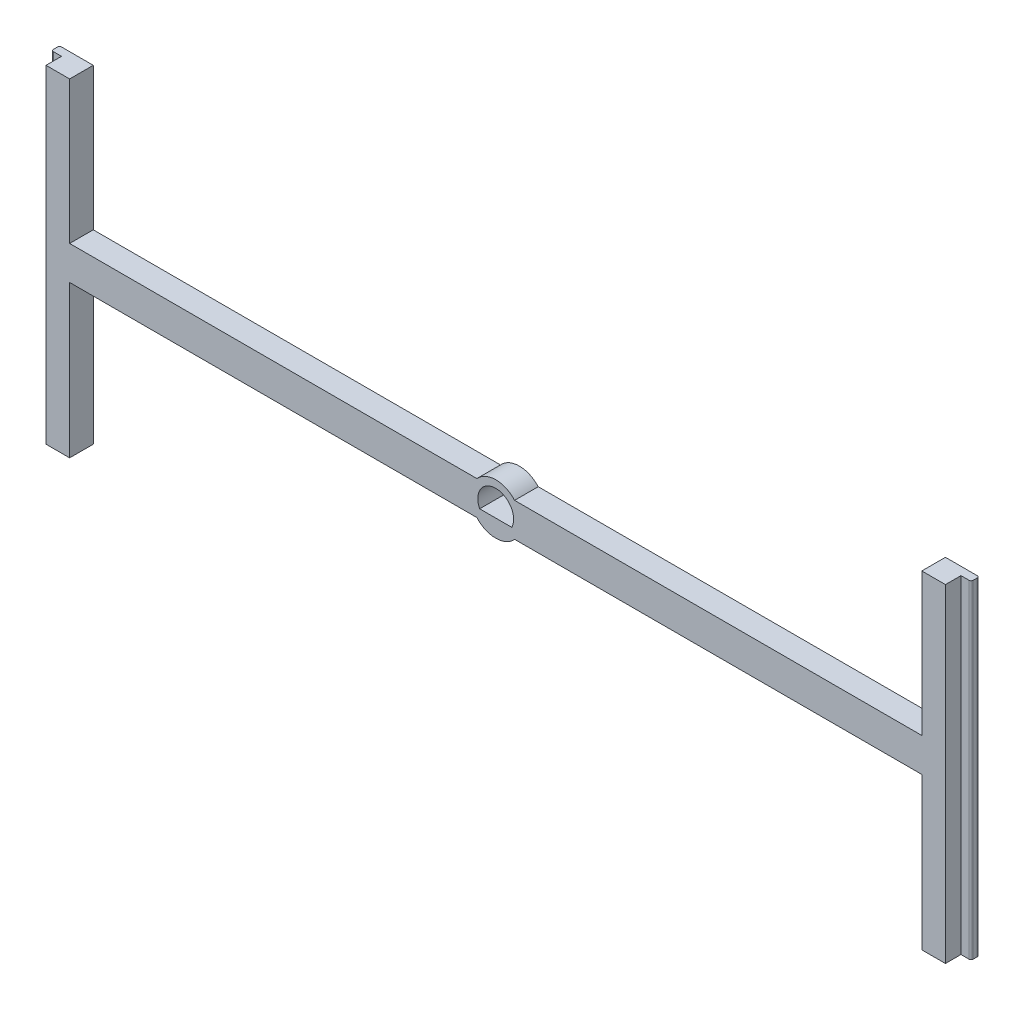
ISO-10303-21;
HEADER;
FILE_DESCRIPTION(('STEP AP214'),'2;1');
FILE_NAME('part.step','',(''),(''),'','','');
FILE_SCHEMA(('AUTOMOTIVE_DESIGN { 1 0 10303 214 1 1 1 1 }'));
ENDSEC;
DATA;
#1=APPLICATION_CONTEXT('core data for automotive mechanical design processes');
#2=APPLICATION_PROTOCOL_DEFINITION('international standard','automotive_design',2000,#1);
#3=PRODUCT_CONTEXT('',#1,'mechanical');
#4=PRODUCT('Part','Part','',(#3));
#5=PRODUCT_RELATED_PRODUCT_CATEGORY('part','',(#4));
#6=PRODUCT_DEFINITION_FORMATION('','',#4);
#7=PRODUCT_DEFINITION_CONTEXT('part definition',#1,'design');
#8=PRODUCT_DEFINITION('design','',#6,#7);
#9=PRODUCT_DEFINITION_SHAPE('','',#8);
#10=(LENGTH_UNIT() NAMED_UNIT(*) SI_UNIT(.MILLI.,.METRE.));
#11=(NAMED_UNIT(*) PLANE_ANGLE_UNIT() SI_UNIT($,.RADIAN.));
#12=(NAMED_UNIT(*) SI_UNIT($,.STERADIAN.) SOLID_ANGLE_UNIT());
#13=UNCERTAINTY_MEASURE_WITH_UNIT(LENGTH_MEASURE(1.E-05),#10,'distance_accuracy_value','');
#14=(GEOMETRIC_REPRESENTATION_CONTEXT(3) GLOBAL_UNCERTAINTY_ASSIGNED_CONTEXT((#13)) GLOBAL_UNIT_ASSIGNED_CONTEXT((#10,
#11,#12)) REPRESENTATION_CONTEXT('',''));
#15=CARTESIAN_POINT('',(0.,0.,0.));
#16=DIRECTION('',(0.,0.,1.));
#17=DIRECTION('',(1.,0.,0.));
#18=AXIS2_PLACEMENT_3D('',#15,#16,#17);
#19=CARTESIAN_POINT('',(0.,0.,3.5));
#20=DIRECTION('',(0.,0.,1.));
#21=DIRECTION('',(1.,0.,0.));
#22=AXIS2_PLACEMENT_3D('',#19,#20,#21);
#23=PLANE('',#22);
#24=DIRECTION('',(1.,0.,0.));
#25=VECTOR('',#24,1.);
#26=CARTESIAN_POINT('',(-68.1,23.6,3.5));
#27=LINE('',#26,#25);
#28=CARTESIAN_POINT('',(-66.6,23.6,3.5));
#29=VERTEX_POINT('',#28);
#30=CARTESIAN_POINT('',(-63.1,23.6,3.5));
#31=VERTEX_POINT('',#30);
#32=EDGE_CURVE('E212',#29,#31,#27,.T.);
#33=ORIENTED_EDGE('',*,*,#32,.F.);
#34=DIRECTION('',(0.,-1.,0.));
#35=VECTOR('',#34,1.);
#36=CARTESIAN_POINT('',(-66.6,25.,3.49999999999998));
#37=LINE('',#36,#35);
#38=CARTESIAN_POINT('',(-66.6,-25.,3.49999999999998));
#39=VERTEX_POINT('',#38);
#40=EDGE_CURVE('E225',#29,#39,#37,.T.);
#41=ORIENTED_EDGE('',*,*,#40,.T.);
#42=DIRECTION('',(1.,0.,0.));
#43=VECTOR('',#42,1.);
#44=CARTESIAN_POINT('',(-63.1,-25.,3.5));
#45=LINE('',#44,#43);
#46=CARTESIAN_POINT('',(-63.1,-25.,3.5));
#47=VERTEX_POINT('',#46);
#48=EDGE_CURVE('E263',#39,#47,#45,.T.);
#49=ORIENTED_EDGE('',*,*,#48,.T.);
#50=DIRECTION('',(0.,1.,0.));
#51=VECTOR('',#50,1.);
#52=CARTESIAN_POINT('',(-63.1,-2.50000000000002,3.5));
#53=LINE('',#52,#51);
#54=CARTESIAN_POINT('',(-63.1,-2.50000000000002,3.5));
#55=VERTEX_POINT('',#54);
#56=EDGE_CURVE('E266',#47,#55,#53,.T.);
#57=ORIENTED_EDGE('',*,*,#56,.T.);
#58=DIRECTION('',(1.,0.,0.));
#59=VECTOR('',#58,1.);
#60=CARTESIAN_POINT('',(-63.1,-2.50000000000002,3.5));
#61=LINE('',#60,#59);
#62=CARTESIAN_POINT('',(-2.79508497187472,-2.50000000000002,3.5));
#63=VERTEX_POINT('',#62);
#64=EDGE_CURVE('E268',#55,#63,#61,.T.);
#65=ORIENTED_EDGE('',*,*,#64,.T.);
#66=CARTESIAN_POINT('',(0.,0.,3.5));
#67=DIRECTION('',(0.,0.,1.));
#68=DIRECTION('',(1.,0.,0.));
#69=AXIS2_PLACEMENT_3D('',#66,#67,#68);
#70=CIRCLE('',#69,3.75);
#71=CARTESIAN_POINT('',(2.79508497187472,-2.50000000000002,3.5));
#72=VERTEX_POINT('',#71);
#73=EDGE_CURVE('E270',#63,#72,#70,.T.);
#74=ORIENTED_EDGE('',*,*,#73,.T.);
#75=DIRECTION('',(1.,0.,0.));
#76=VECTOR('',#75,1.);
#77=CARTESIAN_POINT('',(2.79508497187472,-2.50000000000002,3.5));
#78=LINE('',#77,#76);
#79=CARTESIAN_POINT('',(63.1,-2.5,3.5));
#80=VERTEX_POINT('',#79);
#81=EDGE_CURVE('E272',#72,#80,#78,.T.);
#82=ORIENTED_EDGE('',*,*,#81,.T.);
#83=DIRECTION('',(0.,-1.,0.));
#84=VECTOR('',#83,1.);
#85=CARTESIAN_POINT('',(63.1,-2.5,3.5));
#86=LINE('',#85,#84);
#87=CARTESIAN_POINT('',(63.1,-25.,3.5));
#88=VERTEX_POINT('',#87);
#89=EDGE_CURVE('E274',#80,#88,#86,.T.);
#90=ORIENTED_EDGE('',*,*,#89,.T.);
#91=DIRECTION('',(1.,0.,0.));
#92=VECTOR('',#91,1.);
#93=CARTESIAN_POINT('',(63.1,-25.,3.5));
#94=LINE('',#93,#92);
#95=CARTESIAN_POINT('',(66.6,-25.,3.5));
#96=VERTEX_POINT('',#95);
#97=EDGE_CURVE('E276',#88,#96,#94,.T.);
#98=ORIENTED_EDGE('',*,*,#97,.T.);
#99=DIRECTION('',(0.,-1.,0.));
#100=VECTOR('',#99,1.);
#101=CARTESIAN_POINT('',(66.6,25.,3.5));
#102=LINE('',#101,#100);
#103=CARTESIAN_POINT('',(66.6,23.6,3.5));
#104=VERTEX_POINT('',#103);
#105=EDGE_CURVE('E253',#104,#96,#102,.T.);
#106=ORIENTED_EDGE('',*,*,#105,.F.);
#107=CARTESIAN_POINT('',(63.1,23.6,3.5));
#108=VERTEX_POINT('',#107);
#109=EDGE_CURVE('E230',#108,#104,#27,.T.);
#110=ORIENTED_EDGE('',*,*,#109,.F.);
#111=DIRECTION('',(0.,-1.,0.));
#112=VECTOR('',#111,1.);
#113=CARTESIAN_POINT('',(63.1,25.,3.5));
#114=LINE('',#113,#112);
#115=CARTESIAN_POINT('',(63.1,2.5,3.5));
#116=VERTEX_POINT('',#115);
#117=EDGE_CURVE('E279',#108,#116,#114,.T.);
#118=ORIENTED_EDGE('',*,*,#117,.T.);
#119=DIRECTION('',(-1.,0.,0.));
#120=VECTOR('',#119,1.);
#121=CARTESIAN_POINT('',(2.79508497187472,2.50000000000002,3.5));
#122=LINE('',#121,#120);
#123=CARTESIAN_POINT('',(2.79508497187472,2.50000000000002,3.5));
#124=VERTEX_POINT('',#123);
#125=EDGE_CURVE('E281',#116,#124,#122,.T.);
#126=ORIENTED_EDGE('',*,*,#125,.T.);
#127=CARTESIAN_POINT('',(0.,0.,3.5));
#128=DIRECTION('',(0.,0.,1.));
#129=DIRECTION('',(1.,0.,0.));
#130=AXIS2_PLACEMENT_3D('',#127,#128,#129);
#131=CIRCLE('',#130,3.75);
#132=CARTESIAN_POINT('',(-2.79508497187472,2.50000000000002,3.5));
#133=VERTEX_POINT('',#132);
#134=EDGE_CURVE('E283',#124,#133,#131,.T.);
#135=ORIENTED_EDGE('',*,*,#134,.T.);
#136=DIRECTION('',(-1.,0.,0.));
#137=VECTOR('',#136,1.);
#138=CARTESIAN_POINT('',(-63.1,2.50000000000002,3.5));
#139=LINE('',#138,#137);
#140=CARTESIAN_POINT('',(-63.1,2.50000000000002,3.5));
#141=VERTEX_POINT('',#140);
#142=EDGE_CURVE('E285',#133,#141,#139,.T.);
#143=ORIENTED_EDGE('',*,*,#142,.T.);
#144=DIRECTION('',(0.,1.,0.));
#145=VECTOR('',#144,1.);
#146=CARTESIAN_POINT('',(-63.1,25.,3.5));
#147=LINE('',#146,#145);
#148=EDGE_CURVE('E228',#141,#31,#147,.T.);
#149=ORIENTED_EDGE('',*,*,#148,.T.);
#150=EDGE_LOOP('',(#33,#41,#49,#57,#65,#74,#82,#90,#98,#106,#110,#118,#126,#135,#143,#149));
#151=FACE_BOUND('',#150,.T.);
#152=DIRECTION('',(1.,0.,0.));
#153=VECTOR('',#152,1.);
#154=CARTESIAN_POINT('',(-2.3777300099044,-1.17,3.5));
#155=LINE('',#154,#153);
#156=CARTESIAN_POINT('',(-2.3777300099044,-1.17,3.5));
#157=VERTEX_POINT('',#156);
#158=CARTESIAN_POINT('',(2.37773000990441,-1.17,3.5));
#159=VERTEX_POINT('',#158);
#160=EDGE_CURVE('E246',#157,#159,#155,.T.);
#161=ORIENTED_EDGE('',*,*,#160,.F.);
#162=CARTESIAN_POINT('',(0.,0.,3.5));
#163=DIRECTION('',(0.,0.,1.));
#164=DIRECTION('',(1.,0.,0.));
#165=AXIS2_PLACEMENT_3D('',#162,#163,#164);
#166=CIRCLE('',#165,2.65);
#167=EDGE_CURVE('E243',#159,#157,#166,.T.);
#168=ORIENTED_EDGE('',*,*,#167,.F.);
#169=EDGE_LOOP('',(#161,#168));
#170=FACE_BOUND('',#169,.T.);
#171=ADVANCED_FACE('F35',(#151,#170),#23,.T.);
#172=CARTESIAN_POINT('',(0.,0.,0.));
#173=DIRECTION('',(0.,0.,1.));
#174=DIRECTION('',(1.,0.,0.));
#175=AXIS2_PLACEMENT_3D('',#172,#173,#174);
#176=PLANE('',#175);
#177=DIRECTION('',(1.,0.,0.));
#178=VECTOR('',#177,1.);
#179=CARTESIAN_POINT('',(-68.1,23.6,0.));
#180=LINE('',#179,#178);
#181=CARTESIAN_POINT('',(63.1,23.6,0.));
#182=VERTEX_POINT('',#181);
#183=CARTESIAN_POINT('',(67.8,23.6,0.));
#184=VERTEX_POINT('',#183);
#185=EDGE_CURVE('E229',#182,#184,#180,.T.);
#186=ORIENTED_EDGE('',*,*,#185,.T.);
#187=DIRECTION('',(0.,1.,0.));
#188=VECTOR('',#187,1.);
#189=CARTESIAN_POINT('',(67.8,0.,0.));
#190=LINE('',#189,#188);
#191=CARTESIAN_POINT('',(67.8,-25.,0.));
#192=VERTEX_POINT('',#191);
#193=EDGE_CURVE('E360',#184,#192,#190,.F.);
#194=ORIENTED_EDGE('',*,*,#193,.T.);
#195=DIRECTION('',(1.,0.,0.));
#196=VECTOR('',#195,1.);
#197=CARTESIAN_POINT('',(63.1,-25.,0.));
#198=LINE('',#197,#196);
#199=CARTESIAN_POINT('',(63.1,-25.,0.));
#200=VERTEX_POINT('',#199);
#201=EDGE_CURVE('E302',#200,#192,#198,.T.);
#202=ORIENTED_EDGE('',*,*,#201,.F.);
#203=DIRECTION('',(0.,-1.,0.));
#204=VECTOR('',#203,1.);
#205=CARTESIAN_POINT('',(63.1,-2.5,0.));
#206=LINE('',#205,#204);
#207=CARTESIAN_POINT('',(63.1,-2.5,0.));
#208=VERTEX_POINT('',#207);
#209=EDGE_CURVE('E300',#208,#200,#206,.T.);
#210=ORIENTED_EDGE('',*,*,#209,.F.);
#211=DIRECTION('',(1.,0.,0.));
#212=VECTOR('',#211,1.);
#213=CARTESIAN_POINT('',(2.79508497187472,-2.50000000000002,0.));
#214=LINE('',#213,#212);
#215=CARTESIAN_POINT('',(2.79508497187472,-2.50000000000002,0.));
#216=VERTEX_POINT('',#215);
#217=EDGE_CURVE('E298',#216,#208,#214,.T.);
#218=ORIENTED_EDGE('',*,*,#217,.F.);
#219=CARTESIAN_POINT('',(0.,0.,0.));
#220=DIRECTION('',(0.,0.,1.));
#221=DIRECTION('',(1.,0.,0.));
#222=AXIS2_PLACEMENT_3D('',#219,#220,#221);
#223=CIRCLE('',#222,3.75);
#224=CARTESIAN_POINT('',(-2.79508497187472,-2.50000000000002,0.));
#225=VERTEX_POINT('',#224);
#226=EDGE_CURVE('E296',#225,#216,#223,.T.);
#227=ORIENTED_EDGE('',*,*,#226,.F.);
#228=DIRECTION('',(1.,0.,0.));
#229=VECTOR('',#228,1.);
#230=CARTESIAN_POINT('',(-63.1,-2.50000000000002,0.));
#231=LINE('',#230,#229);
#232=CARTESIAN_POINT('',(-63.1,-2.50000000000002,0.));
#233=VERTEX_POINT('',#232);
#234=EDGE_CURVE('E294',#233,#225,#231,.T.);
#235=ORIENTED_EDGE('',*,*,#234,.F.);
#236=DIRECTION('',(0.,1.,0.));
#237=VECTOR('',#236,1.);
#238=CARTESIAN_POINT('',(-63.1,-2.50000000000002,0.));
#239=LINE('',#238,#237);
#240=CARTESIAN_POINT('',(-63.1,-25.,0.));
#241=VERTEX_POINT('',#240);
#242=EDGE_CURVE('E292',#241,#233,#239,.T.);
#243=ORIENTED_EDGE('',*,*,#242,.F.);
#244=DIRECTION('',(1.,0.,0.));
#245=VECTOR('',#244,1.);
#246=CARTESIAN_POINT('',(-63.1,-25.,0.));
#247=LINE('',#246,#245);
#248=CARTESIAN_POINT('',(-67.8,-25.,0.));
#249=VERTEX_POINT('',#248);
#250=EDGE_CURVE('E290',#249,#241,#247,.T.);
#251=ORIENTED_EDGE('',*,*,#250,.F.);
#252=DIRECTION('',(0.,-1.,0.));
#253=VECTOR('',#252,1.);
#254=CARTESIAN_POINT('',(-67.8,0.,0.));
#255=LINE('',#254,#253);
#256=CARTESIAN_POINT('',(-67.8,23.6,0.));
#257=VERTEX_POINT('',#256);
#258=EDGE_CURVE('E358',#249,#257,#255,.F.);
#259=ORIENTED_EDGE('',*,*,#258,.T.);
#260=CARTESIAN_POINT('',(-63.1,23.6,0.));
#261=VERTEX_POINT('',#260);
#262=EDGE_CURVE('E379',#257,#261,#180,.T.);
#263=ORIENTED_EDGE('',*,*,#262,.T.);
#264=DIRECTION('',(0.,1.,0.));
#265=VECTOR('',#264,1.);
#266=CARTESIAN_POINT('',(-63.1,25.,0.));
#267=LINE('',#266,#265);
#268=CARTESIAN_POINT('',(-63.1,2.50000000000002,0.));
#269=VERTEX_POINT('',#268);
#270=EDGE_CURVE('E261',#269,#261,#267,.T.);
#271=ORIENTED_EDGE('',*,*,#270,.F.);
#272=DIRECTION('',(-1.,0.,0.));
#273=VECTOR('',#272,1.);
#274=CARTESIAN_POINT('',(-63.1,2.50000000000002,0.));
#275=LINE('',#274,#273);
#276=CARTESIAN_POINT('',(-2.79508497187472,2.50000000000002,0.));
#277=VERTEX_POINT('',#276);
#278=EDGE_CURVE('E264',#277,#269,#275,.T.);
#279=ORIENTED_EDGE('',*,*,#278,.F.);
#280=CARTESIAN_POINT('',(0.,0.,0.));
#281=DIRECTION('',(0.,0.,1.));
#282=DIRECTION('',(1.,0.,0.));
#283=AXIS2_PLACEMENT_3D('',#280,#281,#282);
#284=CIRCLE('',#283,3.75);
#285=CARTESIAN_POINT('',(2.79508497187472,2.50000000000002,0.));
#286=VERTEX_POINT('',#285);
#287=EDGE_CURVE('E309',#286,#277,#284,.T.);
#288=ORIENTED_EDGE('',*,*,#287,.F.);
#289=DIRECTION('',(-1.,0.,0.));
#290=VECTOR('',#289,1.);
#291=CARTESIAN_POINT('',(2.79508497187472,2.50000000000002,0.));
#292=LINE('',#291,#290);
#293=CARTESIAN_POINT('',(63.1,2.5,0.));
#294=VERTEX_POINT('',#293);
#295=EDGE_CURVE('E307',#294,#286,#292,.T.);
#296=ORIENTED_EDGE('',*,*,#295,.F.);
#297=DIRECTION('',(0.,-1.,0.));
#298=VECTOR('',#297,1.);
#299=CARTESIAN_POINT('',(63.1,25.,0.));
#300=LINE('',#299,#298);
#301=EDGE_CURVE('E305',#182,#294,#300,.T.);
#302=ORIENTED_EDGE('',*,*,#301,.F.);
#303=EDGE_LOOP('',(#186,#194,#202,#210,#218,#227,#235,#243,#251,#259,#263,#271,#279,#288,#296,#302));
#304=FACE_BOUND('',#303,.T.);
#305=CARTESIAN_POINT('',(0.,0.,0.));
#306=DIRECTION('',(0.,0.,1.));
#307=DIRECTION('',(1.,0.,0.));
#308=AXIS2_PLACEMENT_3D('',#305,#306,#307);
#309=CIRCLE('',#308,2.65);
#310=CARTESIAN_POINT('',(2.37773000990441,-1.17,0.));
#311=VERTEX_POINT('',#310);
#312=CARTESIAN_POINT('',(-2.3777300099044,-1.17,0.));
#313=VERTEX_POINT('',#312);
#314=EDGE_CURVE('E250',#311,#313,#309,.T.);
#315=ORIENTED_EDGE('',*,*,#314,.T.);
#316=DIRECTION('',(1.,0.,0.));
#317=VECTOR('',#316,1.);
#318=CARTESIAN_POINT('',(-2.3777300099044,-1.17,0.));
#319=LINE('',#318,#317);
#320=EDGE_CURVE('E247',#313,#311,#319,.T.);
#321=ORIENTED_EDGE('',*,*,#320,.T.);
#322=EDGE_LOOP('',(#315,#321));
#323=FACE_BOUND('',#322,.T.);
#324=ADVANCED_FACE('F395',(#304,#323),#176,.F.);
#325=CARTESIAN_POINT('',(-63.1,25.,3.5));
#326=DIRECTION('',(-1.,0.,0.));
#327=DIRECTION('',(0.,-1.,0.));
#328=AXIS2_PLACEMENT_3D('',#325,#326,#327);
#329=PLANE('',#328);
#330=ORIENTED_EDGE('',*,*,#270,.T.);
#331=DIRECTION('',(0.,0.,1.));
#332=VECTOR('',#331,1.);
#333=CARTESIAN_POINT('',(-63.1,23.6,3.5));
#334=LINE('',#333,#332);
#335=EDGE_CURVE('E410',#261,#31,#334,.T.);
#336=ORIENTED_EDGE('',*,*,#335,.T.);
#337=ORIENTED_EDGE('',*,*,#148,.F.);
#338=DIRECTION('',(0.,0.,-1.));
#339=VECTOR('',#338,1.);
#340=CARTESIAN_POINT('',(-63.1,2.50000000000002,3.5));
#341=LINE('',#340,#339);
#342=EDGE_CURVE('E287',#141,#269,#341,.T.);
#343=ORIENTED_EDGE('',*,*,#342,.T.);
#344=EDGE_LOOP('',(#330,#336,#337,#343));
#345=FACE_BOUND('',#344,.T.);
#346=ADVANCED_FACE('F490',(#345),#329,.F.);
#347=CARTESIAN_POINT('',(-68.1,25.,3.5));
#348=DIRECTION('',(1.,0.,0.));
#349=DIRECTION('',(0.,0.,-1.));
#350=AXIS2_PLACEMENT_3D('',#347,#348,#349);
#351=PLANE('',#350);
#352=DIRECTION('',(0.,0.,1.));
#353=VECTOR('',#352,1.);
#354=CARTESIAN_POINT('',(-68.1,23.6,0.));
#355=LINE('',#354,#353);
#356=CARTESIAN_POINT('',(-68.1,23.6,0.3));
#357=VERTEX_POINT('',#356);
#358=CARTESIAN_POINT('',(-68.1,23.6,0.899999999999984));
#359=VERTEX_POINT('',#358);
#360=EDGE_CURVE('E378',#357,#359,#355,.T.);
#361=ORIENTED_EDGE('',*,*,#360,.F.);
#362=DIRECTION('',(0.,-1.,0.));
#363=VECTOR('',#362,1.);
#364=CARTESIAN_POINT('',(-68.1,25.,0.3));
#365=LINE('',#364,#363);
#366=CARTESIAN_POINT('',(-68.1,-25.,0.3));
#367=VERTEX_POINT('',#366);
#368=EDGE_CURVE('E370',#357,#367,#365,.T.);
#369=ORIENTED_EDGE('',*,*,#368,.T.);
#370=DIRECTION('',(0.,0.,-1.));
#371=VECTOR('',#370,1.);
#372=CARTESIAN_POINT('',(-68.1,-25.,3.5));
#373=LINE('',#372,#371);
#374=CARTESIAN_POINT('',(-68.1,-25.,0.899999999999984));
#375=VERTEX_POINT('',#374);
#376=EDGE_CURVE('E344',#375,#367,#373,.T.);
#377=ORIENTED_EDGE('',*,*,#376,.F.);
#378=DIRECTION('',(0.,-1.,0.));
#379=VECTOR('',#378,1.);
#380=CARTESIAN_POINT('',(-68.1,25.,0.899999999999984));
#381=LINE('',#380,#379);
#382=EDGE_CURVE('E368',#375,#359,#381,.F.);
#383=ORIENTED_EDGE('',*,*,#382,.T.);
#384=EDGE_LOOP('',(#361,#369,#377,#383));
#385=FACE_BOUND('',#384,.T.);
#386=ADVANCED_FACE('F384',(#385),#351,.F.);
#387=CARTESIAN_POINT('',(-63.1,-25.,3.5));
#388=DIRECTION('',(0.,1.,0.));
#389=DIRECTION('',(-1.,0.,0.));
#390=AXIS2_PLACEMENT_3D('',#387,#388,#389);
#391=PLANE('',#390);
#392=ORIENTED_EDGE('',*,*,#376,.T.);
#393=CARTESIAN_POINT('',(-67.8,-25.,0.3));
#394=DIRECTION('',(0.,1.,0.));
#395=DIRECTION('',(-1.,0.,0.));
#396=AXIS2_PLACEMENT_3D('',#393,#394,#395);
#397=CIRCLE('',#396,0.3);
#398=EDGE_CURVE('E374',#367,#249,#397,.F.);
#399=ORIENTED_EDGE('',*,*,#398,.T.);
#400=ORIENTED_EDGE('',*,*,#250,.T.);
#401=DIRECTION('',(0.,0.,-1.));
#402=VECTOR('',#401,1.);
#403=CARTESIAN_POINT('',(-63.1,-25.,3.5));
#404=LINE('',#403,#402);
#405=EDGE_CURVE('E341',#47,#241,#404,.T.);
#406=ORIENTED_EDGE('',*,*,#405,.F.);
#407=ORIENTED_EDGE('',*,*,#48,.F.);
#408=DIRECTION('',(0.,0.,1.));
#409=VECTOR('',#408,1.);
#410=CARTESIAN_POINT('',(-66.6,-25.,3.49999999999998));
#411=LINE('',#410,#409);
#412=CARTESIAN_POINT('',(-66.6,-25.,1.19999999999998));
#413=VERTEX_POINT('',#412);
#414=EDGE_CURVE('E234',#413,#39,#411,.T.);
#415=ORIENTED_EDGE('',*,*,#414,.F.);
#416=DIRECTION('',(1.,0.,0.));
#417=VECTOR('',#416,1.);
#418=CARTESIAN_POINT('',(-66.6,-25.,1.19999999999998));
#419=LINE('',#418,#417);
#420=CARTESIAN_POINT('',(-67.8,-25.,1.19999999999998));
#421=VERTEX_POINT('',#420);
#422=EDGE_CURVE('E237',#421,#413,#419,.T.);
#423=ORIENTED_EDGE('',*,*,#422,.F.);
#424=CARTESIAN_POINT('',(-67.8,-25.,0.899999999999984));
#425=DIRECTION('',(0.,1.,0.));
#426=DIRECTION('',(-1.,0.,0.));
#427=AXIS2_PLACEMENT_3D('',#424,#425,#426);
#428=CIRCLE('',#427,0.3);
#429=EDGE_CURVE('E58',#421,#375,#428,.F.);
#430=ORIENTED_EDGE('',*,*,#429,.T.);
#431=EDGE_LOOP('',(#392,#399,#400,#406,#407,#415,#423,#430));
#432=FACE_BOUND('',#431,.T.);
#433=ADVANCED_FACE('F390',(#432),#391,.F.);
#434=CARTESIAN_POINT('',(-63.1,-2.50000000000002,3.5));
#435=DIRECTION('',(-1.,0.,0.));
#436=DIRECTION('',(0.,-1.,0.));
#437=AXIS2_PLACEMENT_3D('',#434,#435,#436);
#438=PLANE('',#437);
#439=ORIENTED_EDGE('',*,*,#242,.T.);
#440=DIRECTION('',(0.,0.,-1.));
#441=VECTOR('',#440,1.);
#442=CARTESIAN_POINT('',(-63.1,-2.50000000000002,3.5));
#443=LINE('',#442,#441);
#444=EDGE_CURVE('E338',#55,#233,#443,.T.);
#445=ORIENTED_EDGE('',*,*,#444,.F.);
#446=ORIENTED_EDGE('',*,*,#56,.F.);
#447=ORIENTED_EDGE('',*,*,#405,.T.);
#448=EDGE_LOOP('',(#439,#445,#446,#447));
#449=FACE_BOUND('',#448,.T.);
#450=ADVANCED_FACE('F401',(#449),#438,.F.);
#451=CARTESIAN_POINT('',(-63.1,-2.50000000000002,3.5));
#452=DIRECTION('',(0.,1.,0.));
#453=DIRECTION('',(-1.,0.,0.));
#454=AXIS2_PLACEMENT_3D('',#451,#452,#453);
#455=PLANE('',#454);
#456=ORIENTED_EDGE('',*,*,#234,.T.);
#457=DIRECTION('',(0.,0.,-1.));
#458=VECTOR('',#457,1.);
#459=CARTESIAN_POINT('',(-2.79508497187472,-2.50000000000002,3.5));
#460=LINE('',#459,#458);
#461=EDGE_CURVE('E335',#63,#225,#460,.T.);
#462=ORIENTED_EDGE('',*,*,#461,.F.);
#463=ORIENTED_EDGE('',*,*,#64,.F.);
#464=ORIENTED_EDGE('',*,*,#444,.T.);
#465=EDGE_LOOP('',(#456,#462,#463,#464));
#466=FACE_BOUND('',#465,.T.);
#467=ADVANCED_FACE('F405',(#466),#455,.F.);
#468=CARTESIAN_POINT('',(0.,0.,3.5));
#469=DIRECTION('',(0.,0.,-1.));
#470=DIRECTION('',(-1.,0.,0.));
#471=AXIS2_PLACEMENT_3D('',#468,#469,#470);
#472=CYLINDRICAL_SURFACE('',#471,3.75);
#473=ORIENTED_EDGE('',*,*,#226,.T.);
#474=DIRECTION('',(0.,0.,-1.));
#475=VECTOR('',#474,1.);
#476=CARTESIAN_POINT('',(2.79508497187472,-2.50000000000002,3.5));
#477=LINE('',#476,#475);
#478=EDGE_CURVE('E332',#72,#216,#477,.T.);
#479=ORIENTED_EDGE('',*,*,#478,.F.);
#480=ORIENTED_EDGE('',*,*,#73,.F.);
#481=ORIENTED_EDGE('',*,*,#461,.T.);
#482=EDGE_LOOP('',(#473,#479,#480,#481));
#483=FACE_BOUND('',#482,.T.);
#484=ADVANCED_FACE('F475',(#483),#472,.T.);
#485=CARTESIAN_POINT('',(2.79508497187472,-2.50000000000002,3.5));
#486=DIRECTION('',(0.,1.,0.));
#487=DIRECTION('',(-1.,0.,0.));
#488=AXIS2_PLACEMENT_3D('',#485,#486,#487);
#489=PLANE('',#488);
#490=ORIENTED_EDGE('',*,*,#217,.T.);
#491=DIRECTION('',(0.,0.,-1.));
#492=VECTOR('',#491,1.);
#493=CARTESIAN_POINT('',(63.1,-2.5,3.5));
#494=LINE('',#493,#492);
#495=EDGE_CURVE('E329',#80,#208,#494,.T.);
#496=ORIENTED_EDGE('',*,*,#495,.F.);
#497=ORIENTED_EDGE('',*,*,#81,.F.);
#498=ORIENTED_EDGE('',*,*,#478,.T.);
#499=EDGE_LOOP('',(#490,#496,#497,#498));
#500=FACE_BOUND('',#499,.T.);
#501=ADVANCED_FACE('F473',(#500),#489,.F.);
#502=CARTESIAN_POINT('',(63.1,-2.5,3.5));
#503=DIRECTION('',(1.,0.,0.));
#504=DIRECTION('',(0.,1.,0.));
#505=AXIS2_PLACEMENT_3D('',#502,#503,#504);
#506=PLANE('',#505);
#507=ORIENTED_EDGE('',*,*,#209,.T.);
#508=DIRECTION('',(0.,0.,-1.));
#509=VECTOR('',#508,1.);
#510=CARTESIAN_POINT('',(63.1,-25.,3.5));
#511=LINE('',#510,#509);
#512=EDGE_CURVE('E326',#88,#200,#511,.T.);
#513=ORIENTED_EDGE('',*,*,#512,.F.);
#514=ORIENTED_EDGE('',*,*,#89,.F.);
#515=ORIENTED_EDGE('',*,*,#495,.T.);
#516=EDGE_LOOP('',(#507,#513,#514,#515));
#517=FACE_BOUND('',#516,.T.);
#518=ADVANCED_FACE('F469',(#517),#506,.F.);
#519=CARTESIAN_POINT('',(63.1,-25.,3.5));
#520=DIRECTION('',(0.,1.,0.));
#521=DIRECTION('',(0.,0.,1.));
#522=AXIS2_PLACEMENT_3D('',#519,#520,#521);
#523=PLANE('',#522);
#524=ORIENTED_EDGE('',*,*,#201,.T.);
#525=CARTESIAN_POINT('',(67.8,-25.,0.3));
#526=DIRECTION('',(0.,1.,0.));
#527=DIRECTION('',(0.,0.,1.));
#528=AXIS2_PLACEMENT_3D('',#525,#526,#527);
#529=CIRCLE('',#528,0.3);
#530=CARTESIAN_POINT('',(68.1,-25.,0.3));
#531=VERTEX_POINT('',#530);
#532=EDGE_CURVE('E364',#192,#531,#529,.F.);
#533=ORIENTED_EDGE('',*,*,#532,.T.);
#534=DIRECTION('',(0.,0.,-1.));
#535=VECTOR('',#534,1.);
#536=CARTESIAN_POINT('',(68.1,-25.,3.5));
#537=LINE('',#536,#535);
#538=CARTESIAN_POINT('',(68.1,-25.,0.9));
#539=VERTEX_POINT('',#538);
#540=EDGE_CURVE('E323',#539,#531,#537,.T.);
#541=ORIENTED_EDGE('',*,*,#540,.F.);
#542=CARTESIAN_POINT('',(67.8,-25.,0.9));
#543=DIRECTION('',(0.,1.,0.));
#544=DIRECTION('',(0.,0.,1.));
#545=AXIS2_PLACEMENT_3D('',#542,#543,#544);
#546=CIRCLE('',#545,0.3);
#547=CARTESIAN_POINT('',(67.8,-25.,1.2));
#548=VERTEX_POINT('',#547);
#549=EDGE_CURVE('E362',#539,#548,#546,.F.);
#550=ORIENTED_EDGE('',*,*,#549,.T.);
#551=DIRECTION('',(1.,0.,0.));
#552=VECTOR('',#551,1.);
#553=CARTESIAN_POINT('',(66.6,-25.,1.2));
#554=LINE('',#553,#552);
#555=CARTESIAN_POINT('',(66.6,-25.,1.2));
#556=VERTEX_POINT('',#555);
#557=EDGE_CURVE('E417',#556,#548,#554,.T.);
#558=ORIENTED_EDGE('',*,*,#557,.F.);
#559=DIRECTION('',(0.,0.,-1.));
#560=VECTOR('',#559,1.);
#561=CARTESIAN_POINT('',(66.6,-25.,3.5));
#562=LINE('',#561,#560);
#563=EDGE_CURVE('E239',#96,#556,#562,.T.);
#564=ORIENTED_EDGE('',*,*,#563,.F.);
#565=ORIENTED_EDGE('',*,*,#97,.F.);
#566=ORIENTED_EDGE('',*,*,#512,.T.);
#567=EDGE_LOOP('',(#524,#533,#541,#550,#558,#564,#565,#566));
#568=FACE_BOUND('',#567,.T.);
#569=ADVANCED_FACE('F443',(#568),#523,.F.);
#570=CARTESIAN_POINT('',(68.1,25.,3.5));
#571=DIRECTION('',(-1.,0.,0.));
#572=DIRECTION('',(0.,0.,1.));
#573=AXIS2_PLACEMENT_3D('',#570,#571,#572);
#574=PLANE('',#573);
#575=ORIENTED_EDGE('',*,*,#540,.T.);
#576=DIRECTION('',(0.,1.,0.));
#577=VECTOR('',#576,1.);
#578=CARTESIAN_POINT('',(68.1,25.,0.3));
#579=LINE('',#578,#577);
#580=CARTESIAN_POINT('',(68.1,23.6,0.3));
#581=VERTEX_POINT('',#580);
#582=EDGE_CURVE('E351',#531,#581,#579,.T.);
#583=ORIENTED_EDGE('',*,*,#582,.T.);
#584=DIRECTION('',(0.,0.,1.));
#585=VECTOR('',#584,1.);
#586=CARTESIAN_POINT('',(68.1,23.6,0.));
#587=LINE('',#586,#585);
#588=CARTESIAN_POINT('',(68.1,23.6,0.9));
#589=VERTEX_POINT('',#588);
#590=EDGE_CURVE('E220',#581,#589,#587,.T.);
#591=ORIENTED_EDGE('',*,*,#590,.T.);
#592=DIRECTION('',(0.,-1.,0.));
#593=VECTOR('',#592,1.);
#594=CARTESIAN_POINT('',(68.1,25.,0.9));
#595=LINE('',#594,#593);
#596=EDGE_CURVE('E348',#589,#539,#595,.T.);
#597=ORIENTED_EDGE('',*,*,#596,.T.);
#598=EDGE_LOOP('',(#575,#583,#591,#597));
#599=FACE_BOUND('',#598,.T.);
#600=ADVANCED_FACE('F445',(#599),#574,.F.);
#601=CARTESIAN_POINT('',(63.1,25.,3.5));
#602=DIRECTION('',(1.,0.,0.));
#603=DIRECTION('',(0.,1.,0.));
#604=AXIS2_PLACEMENT_3D('',#601,#602,#603);
#605=PLANE('',#604);
#606=ORIENTED_EDGE('',*,*,#117,.F.);
#607=DIRECTION('',(0.,0.,-1.));
#608=VECTOR('',#607,1.);
#609=CARTESIAN_POINT('',(63.1,23.6,3.5));
#610=LINE('',#609,#608);
#611=EDGE_CURVE('E412',#108,#182,#610,.T.);
#612=ORIENTED_EDGE('',*,*,#611,.T.);
#613=ORIENTED_EDGE('',*,*,#301,.T.);
#614=DIRECTION('',(0.,0.,-1.));
#615=VECTOR('',#614,1.);
#616=CARTESIAN_POINT('',(63.1,2.5,3.5));
#617=LINE('',#616,#615);
#618=EDGE_CURVE('E320',#116,#294,#617,.T.);
#619=ORIENTED_EDGE('',*,*,#618,.F.);
#620=EDGE_LOOP('',(#606,#612,#613,#619));
#621=FACE_BOUND('',#620,.T.);
#622=ADVANCED_FACE('F507',(#621),#605,.F.);
#623=CARTESIAN_POINT('',(2.79508497187472,2.50000000000002,3.5));
#624=DIRECTION('',(0.,-1.,0.));
#625=DIRECTION('',(1.,0.,0.));
#626=AXIS2_PLACEMENT_3D('',#623,#624,#625);
#627=PLANE('',#626);
#628=ORIENTED_EDGE('',*,*,#295,.T.);
#629=DIRECTION('',(0.,0.,-1.));
#630=VECTOR('',#629,1.);
#631=CARTESIAN_POINT('',(2.79508497187472,2.50000000000002,3.5));
#632=LINE('',#631,#630);
#633=EDGE_CURVE('E317',#124,#286,#632,.T.);
#634=ORIENTED_EDGE('',*,*,#633,.F.);
#635=ORIENTED_EDGE('',*,*,#125,.F.);
#636=ORIENTED_EDGE('',*,*,#618,.T.);
#637=EDGE_LOOP('',(#628,#634,#635,#636));
#638=FACE_BOUND('',#637,.T.);
#639=ADVANCED_FACE('F503',(#638),#627,.F.);
#640=CARTESIAN_POINT('',(0.,0.,3.5));
#641=DIRECTION('',(0.,0.,-1.));
#642=DIRECTION('',(-1.,0.,0.));
#643=AXIS2_PLACEMENT_3D('',#640,#641,#642);
#644=CYLINDRICAL_SURFACE('',#643,3.75);
#645=ORIENTED_EDGE('',*,*,#287,.T.);
#646=DIRECTION('',(0.,0.,-1.));
#647=VECTOR('',#646,1.);
#648=CARTESIAN_POINT('',(-2.79508497187472,2.50000000000002,3.5));
#649=LINE('',#648,#647);
#650=EDGE_CURVE('E314',#133,#277,#649,.T.);
#651=ORIENTED_EDGE('',*,*,#650,.F.);
#652=ORIENTED_EDGE('',*,*,#134,.F.);
#653=ORIENTED_EDGE('',*,*,#633,.T.);
#654=EDGE_LOOP('',(#645,#651,#652,#653));
#655=FACE_BOUND('',#654,.T.);
#656=ADVANCED_FACE('F499',(#655),#644,.T.);
#657=CARTESIAN_POINT('',(-63.1,2.50000000000002,3.5));
#658=DIRECTION('',(0.,-1.,0.));
#659=DIRECTION('',(1.,0.,0.));
#660=AXIS2_PLACEMENT_3D('',#657,#658,#659);
#661=PLANE('',#660);
#662=ORIENTED_EDGE('',*,*,#278,.T.);
#663=ORIENTED_EDGE('',*,*,#342,.F.);
#664=ORIENTED_EDGE('',*,*,#142,.F.);
#665=ORIENTED_EDGE('',*,*,#650,.T.);
#666=EDGE_LOOP('',(#662,#663,#664,#665));
#667=FACE_BOUND('',#666,.T.);
#668=ADVANCED_FACE('F496',(#667),#661,.F.);
#669=CARTESIAN_POINT('',(0.,0.,3.5));
#670=DIRECTION('',(0.,0.,-1.));
#671=DIRECTION('',(-1.,0.,0.));
#672=AXIS2_PLACEMENT_3D('',#669,#670,#671);
#673=CYLINDRICAL_SURFACE('',#672,2.65);
#674=ORIENTED_EDGE('',*,*,#314,.F.);
#675=DIRECTION('',(0.,0.,-1.));
#676=VECTOR('',#675,1.);
#677=CARTESIAN_POINT('',(2.37773000990441,-1.17,3.5));
#678=LINE('',#677,#676);
#679=EDGE_CURVE('E249',#159,#311,#678,.T.);
#680=ORIENTED_EDGE('',*,*,#679,.F.);
#681=ORIENTED_EDGE('',*,*,#167,.T.);
#682=DIRECTION('',(0.,0.,-1.));
#683=VECTOR('',#682,1.);
#684=CARTESIAN_POINT('',(-2.3777300099044,-1.17,3.5));
#685=LINE('',#684,#683);
#686=EDGE_CURVE('E258',#157,#313,#685,.T.);
#687=ORIENTED_EDGE('',*,*,#686,.T.);
#688=EDGE_LOOP('',(#674,#680,#681,#687));
#689=FACE_BOUND('',#688,.T.);
#690=ADVANCED_FACE('F493',(#689),#673,.F.);
#691=CARTESIAN_POINT('',(-2.3777300099044,-1.17,3.5));
#692=DIRECTION('',(0.,1.,0.));
#693=DIRECTION('',(-1.,0.,0.));
#694=AXIS2_PLACEMENT_3D('',#691,#692,#693);
#695=PLANE('',#694);
#696=ORIENTED_EDGE('',*,*,#320,.F.);
#697=ORIENTED_EDGE('',*,*,#686,.F.);
#698=ORIENTED_EDGE('',*,*,#160,.T.);
#699=ORIENTED_EDGE('',*,*,#679,.T.);
#700=EDGE_LOOP('',(#696,#697,#698,#699));
#701=FACE_BOUND('',#700,.T.);
#702=ADVANCED_FACE('F559',(#701),#695,.T.);
#703=CARTESIAN_POINT('',(66.6,25.,3.5));
#704=DIRECTION('',(-1.,0.,0.));
#705=DIRECTION('',(0.,0.,1.));
#706=AXIS2_PLACEMENT_3D('',#703,#704,#705);
#707=PLANE('',#706);
#708=DIRECTION('',(0.,-1.,0.));
#709=VECTOR('',#708,1.);
#710=CARTESIAN_POINT('',(66.6,25.,1.2));
#711=LINE('',#710,#709);
#712=CARTESIAN_POINT('',(66.6,23.6,1.2));
#713=VERTEX_POINT('',#712);
#714=EDGE_CURVE('E415',#713,#556,#711,.T.);
#715=ORIENTED_EDGE('',*,*,#714,.F.);
#716=DIRECTION('',(0.,0.,1.));
#717=VECTOR('',#716,1.);
#718=CARTESIAN_POINT('',(66.6,23.6,3.5));
#719=LINE('',#718,#717);
#720=EDGE_CURVE('E425',#713,#104,#719,.T.);
#721=ORIENTED_EDGE('',*,*,#720,.T.);
#722=ORIENTED_EDGE('',*,*,#105,.T.);
#723=ORIENTED_EDGE('',*,*,#563,.T.);
#724=EDGE_LOOP('',(#715,#721,#722,#723));
#725=FACE_BOUND('',#724,.T.);
#726=ADVANCED_FACE('F460',(#725),#707,.F.);
#727=CARTESIAN_POINT('',(66.6,25.,1.2));
#728=DIRECTION('',(0.,0.,-1.));
#729=DIRECTION('',(-1.,0.,0.));
#730=AXIS2_PLACEMENT_3D('',#727,#728,#729);
#731=PLANE('',#730);
#732=ORIENTED_EDGE('',*,*,#557,.T.);
#733=DIRECTION('',(0.,-1.,0.));
#734=VECTOR('',#733,1.);
#735=CARTESIAN_POINT('',(67.8,25.,1.2));
#736=LINE('',#735,#734);
#737=CARTESIAN_POINT('',(67.8,23.6,1.2));
#738=VERTEX_POINT('',#737);
#739=EDGE_CURVE('E366',#548,#738,#736,.F.);
#740=ORIENTED_EDGE('',*,*,#739,.T.);
#741=DIRECTION('',(-1.,0.,0.));
#742=VECTOR('',#741,1.);
#743=CARTESIAN_POINT('',(66.6,23.6,1.2));
#744=LINE('',#743,#742);
#745=EDGE_CURVE('E219',#738,#713,#744,.T.);
#746=ORIENTED_EDGE('',*,*,#745,.T.);
#747=ORIENTED_EDGE('',*,*,#714,.T.);
#748=EDGE_LOOP('',(#732,#740,#746,#747));
#749=FACE_BOUND('',#748,.T.);
#750=ADVANCED_FACE('F455',(#749),#731,.F.);
#751=CARTESIAN_POINT('',(-66.6,25.,3.49999999999998));
#752=DIRECTION('',(1.,0.,0.));
#753=DIRECTION('',(0.,0.,-1.));
#754=AXIS2_PLACEMENT_3D('',#751,#752,#753);
#755=PLANE('',#754);
#756=ORIENTED_EDGE('',*,*,#40,.F.);
#757=DIRECTION('',(0.,0.,-1.));
#758=VECTOR('',#757,1.);
#759=CARTESIAN_POINT('',(-66.6,23.6,3.49999999999998));
#760=LINE('',#759,#758);
#761=CARTESIAN_POINT('',(-66.6,23.6,1.19999999999998));
#762=VERTEX_POINT('',#761);
#763=EDGE_CURVE('E207',#29,#762,#760,.T.);
#764=ORIENTED_EDGE('',*,*,#763,.T.);
#765=DIRECTION('',(0.,-1.,0.));
#766=VECTOR('',#765,1.);
#767=CARTESIAN_POINT('',(-66.6,25.,1.19999999999998));
#768=LINE('',#767,#766);
#769=EDGE_CURVE('E236',#762,#413,#768,.T.);
#770=ORIENTED_EDGE('',*,*,#769,.T.);
#771=ORIENTED_EDGE('',*,*,#414,.T.);
#772=EDGE_LOOP('',(#756,#764,#770,#771));
#773=FACE_BOUND('',#772,.T.);
#774=ADVANCED_FACE('F232',(#773),#755,.F.);
#775=CARTESIAN_POINT('',(-66.6,25.,1.19999999999998));
#776=DIRECTION('',(0.,0.,-1.));
#777=DIRECTION('',(-1.,0.,0.));
#778=AXIS2_PLACEMENT_3D('',#775,#776,#777);
#779=PLANE('',#778);
#780=DIRECTION('',(-1.,0.,0.));
#781=VECTOR('',#780,1.);
#782=CARTESIAN_POINT('',(-66.6,23.6,1.19999999999998));
#783=LINE('',#782,#781);
#784=CARTESIAN_POINT('',(-67.8,23.6,1.19999999999998));
#785=VERTEX_POINT('',#784);
#786=EDGE_CURVE('E214',#762,#785,#783,.T.);
#787=ORIENTED_EDGE('',*,*,#786,.T.);
#788=DIRECTION('',(0.,-1.,0.));
#789=VECTOR('',#788,1.);
#790=CARTESIAN_POINT('',(-67.8,25.,1.19999999999998));
#791=LINE('',#790,#789);
#792=EDGE_CURVE('E11',#785,#421,#791,.T.);
#793=ORIENTED_EDGE('',*,*,#792,.T.);
#794=ORIENTED_EDGE('',*,*,#422,.T.);
#795=ORIENTED_EDGE('',*,*,#769,.F.);
#796=EDGE_LOOP('',(#787,#793,#794,#795));
#797=FACE_BOUND('',#796,.T.);
#798=ADVANCED_FACE('F586',(#797),#779,.F.);
#799=CARTESIAN_POINT('',(-68.1,23.6,0.));
#800=DIRECTION('',(0.,-1.,0.));
#801=DIRECTION('',(0.,0.,-1.));
#802=AXIS2_PLACEMENT_3D('',#799,#800,#801);
#803=PLANE('',#802);
#804=ORIENTED_EDGE('',*,*,#262,.F.);
#805=CARTESIAN_POINT('',(-67.8,23.6,0.3));
#806=DIRECTION('',(0.,-1.,0.));
#807=DIRECTION('',(0.,0.,-1.));
#808=AXIS2_PLACEMENT_3D('',#805,#806,#807);
#809=CIRCLE('',#808,0.3);
#810=EDGE_CURVE('E43',#257,#357,#809,.F.);
#811=ORIENTED_EDGE('',*,*,#810,.T.);
#812=ORIENTED_EDGE('',*,*,#360,.T.);
#813=CARTESIAN_POINT('',(-67.8,23.6,0.899999999999984));
#814=DIRECTION('',(0.,-1.,0.));
#815=DIRECTION('',(0.,0.,-1.));
#816=AXIS2_PLACEMENT_3D('',#813,#814,#815);
#817=CIRCLE('',#816,0.3);
#818=EDGE_CURVE('E50',#359,#785,#817,.F.);
#819=ORIENTED_EDGE('',*,*,#818,.T.);
#820=ORIENTED_EDGE('',*,*,#786,.F.);
#821=ORIENTED_EDGE('',*,*,#763,.F.);
#822=ORIENTED_EDGE('',*,*,#32,.T.);
#823=ORIENTED_EDGE('',*,*,#335,.F.);
#824=EDGE_LOOP('',(#804,#811,#812,#819,#820,#821,#822,#823));
#825=FACE_BOUND('',#824,.T.);
#826=ADVANCED_FACE('F210',(#825),#803,.F.);
#827=ORIENTED_EDGE('',*,*,#590,.F.);
#828=CARTESIAN_POINT('',(67.8,23.6,0.3));
#829=DIRECTION('',(0.,-1.,0.));
#830=DIRECTION('',(0.,0.,-1.));
#831=AXIS2_PLACEMENT_3D('',#828,#829,#830);
#832=CIRCLE('',#831,0.3);
#833=EDGE_CURVE('E356',#581,#184,#832,.F.);
#834=ORIENTED_EDGE('',*,*,#833,.T.);
#835=ORIENTED_EDGE('',*,*,#185,.F.);
#836=ORIENTED_EDGE('',*,*,#611,.F.);
#837=ORIENTED_EDGE('',*,*,#109,.T.);
#838=ORIENTED_EDGE('',*,*,#720,.F.);
#839=ORIENTED_EDGE('',*,*,#745,.F.);
#840=CARTESIAN_POINT('',(67.8,23.6,0.9));
#841=DIRECTION('',(0.,-1.,0.));
#842=DIRECTION('',(0.,0.,-1.));
#843=AXIS2_PLACEMENT_3D('',#840,#841,#842);
#844=CIRCLE('',#843,0.3);
#845=EDGE_CURVE('E354',#738,#589,#844,.F.);
#846=ORIENTED_EDGE('',*,*,#845,.T.);
#847=EDGE_LOOP('',(#827,#834,#835,#836,#837,#838,#839,#846));
#848=FACE_BOUND('',#847,.T.);
#849=ADVANCED_FACE('F601',(#848),#803,.F.);
#850=CARTESIAN_POINT('',(67.8,25.,0.3));
#851=DIRECTION('',(0.,1.,0.));
#852=DIRECTION('',(0.,0.,1.));
#853=AXIS2_PLACEMENT_3D('',#850,#851,#852);
#854=CYLINDRICAL_SURFACE('',#853,0.3);
#855=ORIENTED_EDGE('',*,*,#532,.F.);
#856=ORIENTED_EDGE('',*,*,#193,.F.);
#857=ORIENTED_EDGE('',*,*,#833,.F.);
#858=ORIENTED_EDGE('',*,*,#582,.F.);
#859=EDGE_LOOP('',(#855,#856,#857,#858));
#860=FACE_BOUND('',#859,.T.);
#861=ADVANCED_FACE('F439',(#860),#854,.T.);
#862=CARTESIAN_POINT('',(67.8,25.,0.9));
#863=DIRECTION('',(0.,-1.,0.));
#864=DIRECTION('',(0.,0.,-1.));
#865=AXIS2_PLACEMENT_3D('',#862,#863,#864);
#866=CYLINDRICAL_SURFACE('',#865,0.3);
#867=ORIENTED_EDGE('',*,*,#845,.F.);
#868=ORIENTED_EDGE('',*,*,#739,.F.);
#869=ORIENTED_EDGE('',*,*,#549,.F.);
#870=ORIENTED_EDGE('',*,*,#596,.F.);
#871=EDGE_LOOP('',(#867,#868,#869,#870));
#872=FACE_BOUND('',#871,.T.);
#873=ADVANCED_FACE('F450',(#872),#866,.T.);
#874=CARTESIAN_POINT('',(-67.8,25.,0.3));
#875=DIRECTION('',(0.,-1.,0.));
#876=DIRECTION('',(0.,0.,-1.));
#877=AXIS2_PLACEMENT_3D('',#874,#875,#876);
#878=CYLINDRICAL_SURFACE('',#877,0.3);
#879=ORIENTED_EDGE('',*,*,#810,.F.);
#880=ORIENTED_EDGE('',*,*,#258,.F.);
#881=ORIENTED_EDGE('',*,*,#398,.F.);
#882=ORIENTED_EDGE('',*,*,#368,.F.);
#883=EDGE_LOOP('',(#879,#880,#881,#882));
#884=FACE_BOUND('',#883,.T.);
#885=ADVANCED_FACE('F387',(#884),#878,.T.);
#886=CARTESIAN_POINT('',(-67.8,25.,0.899999999999984));
#887=DIRECTION('',(0.,-1.,0.));
#888=DIRECTION('',(0.,0.,-1.));
#889=AXIS2_PLACEMENT_3D('',#886,#887,#888);
#890=CYLINDRICAL_SURFACE('',#889,0.3);
#891=ORIENTED_EDGE('',*,*,#818,.F.);
#892=ORIENTED_EDGE('',*,*,#382,.F.);
#893=ORIENTED_EDGE('',*,*,#429,.F.);
#894=ORIENTED_EDGE('',*,*,#792,.F.);
#895=EDGE_LOOP('',(#891,#892,#893,#894));
#896=FACE_BOUND('',#895,.T.);
#897=ADVANCED_FACE('F37',(#896),#890,.T.);
#898=CLOSED_SHELL('',(#171,#324,#346,#386,#433,#450,#467,#484,#501,#518,#569,#600,#622,#639,
#656,#668,#690,#702,#726,#750,#774,#798,#826,#849,#861,#873,#885,#897));
#899=MANIFOLD_SOLID_BREP('B2',#898);
#900=ADVANCED_BREP_SHAPE_REPRESENTATION('',(#18,#899),#14);
#901=SHAPE_DEFINITION_REPRESENTATION(#9,#900);
ENDSEC;
END-ISO-10303-21;
